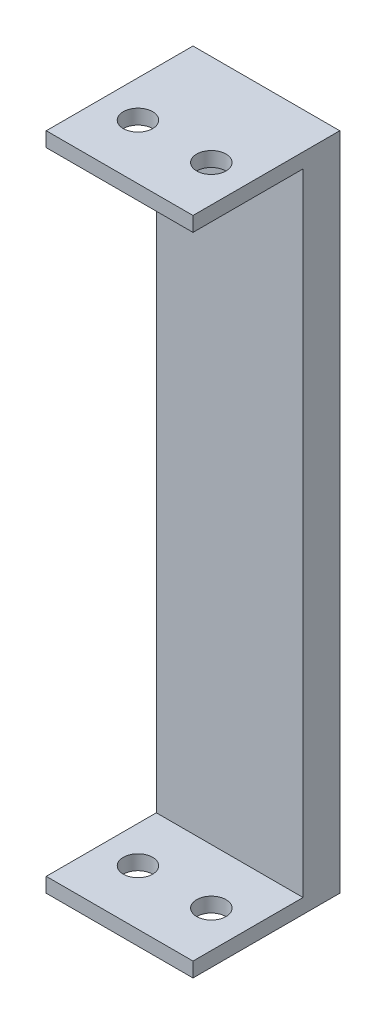
ISO-10303-21;
HEADER;
FILE_DESCRIPTION(('STEP AP214'),'2;1');
FILE_NAME('part.step','',(''),(''),'','','');
FILE_SCHEMA(('AUTOMOTIVE_DESIGN { 1 0 10303 214 1 1 1 1 }'));
ENDSEC;
DATA;
#1=APPLICATION_CONTEXT('core data for automotive mechanical design processes');
#2=APPLICATION_PROTOCOL_DEFINITION('international standard','automotive_design',2000,#1);
#3=PRODUCT_CONTEXT('',#1,'mechanical');
#4=PRODUCT('Part','Part','',(#3));
#5=PRODUCT_RELATED_PRODUCT_CATEGORY('part','',(#4));
#6=PRODUCT_DEFINITION_FORMATION('','',#4);
#7=PRODUCT_DEFINITION_CONTEXT('part definition',#1,'design');
#8=PRODUCT_DEFINITION('design','',#6,#7);
#9=PRODUCT_DEFINITION_SHAPE('','',#8);
#10=(LENGTH_UNIT() NAMED_UNIT(*) SI_UNIT(.MILLI.,.METRE.));
#11=(NAMED_UNIT(*) PLANE_ANGLE_UNIT() SI_UNIT($,.RADIAN.));
#12=(NAMED_UNIT(*) SI_UNIT($,.STERADIAN.) SOLID_ANGLE_UNIT());
#13=UNCERTAINTY_MEASURE_WITH_UNIT(LENGTH_MEASURE(1.E-05),#10,'distance_accuracy_value','');
#14=(GEOMETRIC_REPRESENTATION_CONTEXT(3) GLOBAL_UNCERTAINTY_ASSIGNED_CONTEXT((#13)) GLOBAL_UNIT_ASSIGNED_CONTEXT((#10,
#11,#12)) REPRESENTATION_CONTEXT('',''));
#15=CARTESIAN_POINT('',(0.,0.,0.));
#16=DIRECTION('',(0.,0.,1.));
#17=DIRECTION('',(1.,0.,0.));
#18=AXIS2_PLACEMENT_3D('',#15,#16,#17);
#19=CARTESIAN_POINT('',(0.,0.,20.));
#20=DIRECTION('',(0.,0.,-1.));
#21=DIRECTION('',(-1.,0.,0.));
#22=AXIS2_PLACEMENT_3D('',#19,#20,#21);
#23=PLANE('',#22);
#24=DIRECTION('',(0.,-1.,0.));
#25=VECTOR('',#24,1.);
#26=CARTESIAN_POINT('',(-10.,-45.,20.));
#27=LINE('',#26,#25);
#28=CARTESIAN_POINT('',(-10.,45.,20.));
#29=VERTEX_POINT('',#28);
#30=CARTESIAN_POINT('',(-10.,43.,20.));
#31=VERTEX_POINT('',#30);
#32=EDGE_CURVE('E134',#29,#31,#27,.T.);
#33=ORIENTED_EDGE('',*,*,#32,.T.);
#34=DIRECTION('',(1.,0.,0.));
#35=VECTOR('',#34,1.);
#36=CARTESIAN_POINT('',(-10.001,43.,20.));
#37=LINE('',#36,#35);
#38=CARTESIAN_POINT('',(10.,43.,20.));
#39=VERTEX_POINT('',#38);
#40=EDGE_CURVE('E183',#31,#39,#37,.T.);
#41=ORIENTED_EDGE('',*,*,#40,.T.);
#42=DIRECTION('',(0.,1.,0.));
#43=VECTOR('',#42,1.);
#44=CARTESIAN_POINT('',(10.,-45.,20.));
#45=LINE('',#44,#43);
#46=CARTESIAN_POINT('',(10.,45.,20.));
#47=VERTEX_POINT('',#46);
#48=EDGE_CURVE('E89',#39,#47,#45,.T.);
#49=ORIENTED_EDGE('',*,*,#48,.T.);
#50=DIRECTION('',(-1.,0.,0.));
#51=VECTOR('',#50,1.);
#52=CARTESIAN_POINT('',(-10.,45.,20.));
#53=LINE('',#52,#51);
#54=EDGE_CURVE('E128',#47,#29,#53,.T.);
#55=ORIENTED_EDGE('',*,*,#54,.T.);
#56=EDGE_LOOP('',(#33,#41,#49,#55));
#57=FACE_BOUND('',#56,.T.);
#58=ADVANCED_FACE('F34',(#57),#23,.F.);
#59=CARTESIAN_POINT('',(10.,-45.,20.));
#60=DIRECTION('',(-1.,0.,0.));
#61=DIRECTION('',(0.,0.,1.));
#62=AXIS2_PLACEMENT_3D('',#59,#60,#61);
#63=PLANE('',#62);
#64=ORIENTED_EDGE('',*,*,#48,.F.);
#65=DIRECTION('',(0.,0.,1.));
#66=VECTOR('',#65,1.);
#67=CARTESIAN_POINT('',(10.,43.,20.));
#68=LINE('',#67,#66);
#69=CARTESIAN_POINT('',(10.,43.,5.));
#70=VERTEX_POINT('',#69);
#71=EDGE_CURVE('E117',#70,#39,#68,.T.);
#72=ORIENTED_EDGE('',*,*,#71,.F.);
#73=DIRECTION('',(0.,1.,0.));
#74=VECTOR('',#73,1.);
#75=CARTESIAN_POINT('',(10.,43.,5.));
#76=LINE('',#75,#74);
#77=CARTESIAN_POINT('',(10.,-43.,4.99999999999999));
#78=VERTEX_POINT('',#77);
#79=EDGE_CURVE('E124',#78,#70,#76,.T.);
#80=ORIENTED_EDGE('',*,*,#79,.F.);
#81=DIRECTION('',(0.,0.,-1.));
#82=VECTOR('',#81,1.);
#83=CARTESIAN_POINT('',(10.,-43.,4.99999999999999));
#84=LINE('',#83,#82);
#85=CARTESIAN_POINT('',(10.,-43.,20.));
#86=VERTEX_POINT('',#85);
#87=EDGE_CURVE('E113',#86,#78,#84,.T.);
#88=ORIENTED_EDGE('',*,*,#87,.F.);
#89=CARTESIAN_POINT('',(10.,-45.,20.));
#90=VERTEX_POINT('',#89);
#91=EDGE_CURVE('E121',#90,#86,#45,.T.);
#92=ORIENTED_EDGE('',*,*,#91,.F.);
#93=DIRECTION('',(0.,0.,-1.));
#94=VECTOR('',#93,1.);
#95=CARTESIAN_POINT('',(10.,-45.,20.));
#96=LINE('',#95,#94);
#97=CARTESIAN_POINT('',(10.,-45.,0.));
#98=VERTEX_POINT('',#97);
#99=EDGE_CURVE('E138',#90,#98,#96,.T.);
#100=ORIENTED_EDGE('',*,*,#99,.T.);
#101=DIRECTION('',(0.,1.,0.));
#102=VECTOR('',#101,1.);
#103=CARTESIAN_POINT('',(10.,-45.,0.));
#104=LINE('',#103,#102);
#105=CARTESIAN_POINT('',(10.,45.,0.));
#106=VERTEX_POINT('',#105);
#107=EDGE_CURVE('E139',#98,#106,#104,.T.);
#108=ORIENTED_EDGE('',*,*,#107,.T.);
#109=DIRECTION('',(0.,0.,-1.));
#110=VECTOR('',#109,1.);
#111=CARTESIAN_POINT('',(10.,45.,20.));
#112=LINE('',#111,#110);
#113=EDGE_CURVE('E11',#47,#106,#112,.T.);
#114=ORIENTED_EDGE('',*,*,#113,.F.);
#115=EDGE_LOOP('',(#64,#72,#80,#88,#92,#100,#108,#114));
#116=FACE_BOUND('',#115,.T.);
#117=ADVANCED_FACE('F36',(#116),#63,.F.);
#118=CARTESIAN_POINT('',(-10.,45.,20.));
#119=DIRECTION('',(0.,-1.,0.));
#120=DIRECTION('',(0.,0.,-1.));
#121=AXIS2_PLACEMENT_3D('',#118,#119,#120);
#122=PLANE('',#121);
#123=CARTESIAN_POINT('',(-5.,45.,12.5));
#124=DIRECTION('',(0.,-1.,0.));
#125=DIRECTION('',(0.,0.,-1.));
#126=AXIS2_PLACEMENT_3D('',#123,#124,#125);
#127=CIRCLE('',#126,2.);
#128=CARTESIAN_POINT('',(-5.,45.,10.5));
#129=VERTEX_POINT('',#128);
#130=EDGE_CURVE('E173',#129,#129,#127,.F.);
#131=ORIENTED_EDGE('',*,*,#130,.F.);
#132=EDGE_LOOP('',(#131));
#133=FACE_BOUND('',#132,.T.);
#134=CARTESIAN_POINT('',(5.,45.,12.5));
#135=DIRECTION('',(0.,-1.,0.));
#136=DIRECTION('',(0.,0.,-1.));
#137=AXIS2_PLACEMENT_3D('',#134,#135,#136);
#138=CIRCLE('',#137,2.);
#139=CARTESIAN_POINT('',(5.,45.,10.5));
#140=VERTEX_POINT('',#139);
#141=EDGE_CURVE('E162',#140,#140,#138,.F.);
#142=ORIENTED_EDGE('',*,*,#141,.F.);
#143=EDGE_LOOP('',(#142));
#144=FACE_BOUND('',#143,.T.);
#145=DIRECTION('',(-1.,0.,0.));
#146=VECTOR('',#145,1.);
#147=CARTESIAN_POINT('',(-10.,45.,0.));
#148=LINE('',#147,#146);
#149=CARTESIAN_POINT('',(-10.,45.,0.));
#150=VERTEX_POINT('',#149);
#151=EDGE_CURVE('E142',#106,#150,#148,.T.);
#152=ORIENTED_EDGE('',*,*,#151,.T.);
#153=DIRECTION('',(0.,0.,-1.));
#154=VECTOR('',#153,1.);
#155=CARTESIAN_POINT('',(-10.,45.,20.));
#156=LINE('',#155,#154);
#157=EDGE_CURVE('E43',#29,#150,#156,.T.);
#158=ORIENTED_EDGE('',*,*,#157,.F.);
#159=ORIENTED_EDGE('',*,*,#54,.F.);
#160=ORIENTED_EDGE('',*,*,#113,.T.);
#161=EDGE_LOOP('',(#152,#158,#159,#160));
#162=FACE_BOUND('',#161,.T.);
#163=ADVANCED_FACE('F202',(#133,#144,#162),#122,.F.);
#164=CARTESIAN_POINT('',(-10.,-45.,20.));
#165=DIRECTION('',(1.,0.,0.));
#166=DIRECTION('',(0.,0.,-1.));
#167=AXIS2_PLACEMENT_3D('',#164,#165,#166);
#168=PLANE('',#167);
#169=DIRECTION('',(0.,-1.,0.));
#170=VECTOR('',#169,1.);
#171=CARTESIAN_POINT('',(-10.,43.,5.));
#172=LINE('',#171,#170);
#173=CARTESIAN_POINT('',(-10.,43.,5.));
#174=VERTEX_POINT('',#173);
#175=CARTESIAN_POINT('',(-10.,-43.,4.99999999999999));
#176=VERTEX_POINT('',#175);
#177=EDGE_CURVE('E176',#174,#176,#172,.T.);
#178=ORIENTED_EDGE('',*,*,#177,.F.);
#179=DIRECTION('',(0.,0.,-1.));
#180=VECTOR('',#179,1.);
#181=CARTESIAN_POINT('',(-10.,43.,20.));
#182=LINE('',#181,#180);
#183=EDGE_CURVE('E125',#31,#174,#182,.T.);
#184=ORIENTED_EDGE('',*,*,#183,.F.);
#185=ORIENTED_EDGE('',*,*,#32,.F.);
#186=ORIENTED_EDGE('',*,*,#157,.T.);
#187=DIRECTION('',(0.,-1.,0.));
#188=VECTOR('',#187,1.);
#189=CARTESIAN_POINT('',(-10.,-45.,0.));
#190=LINE('',#189,#188);
#191=CARTESIAN_POINT('',(-10.,-45.,0.));
#192=VERTEX_POINT('',#191);
#193=EDGE_CURVE('E144',#150,#192,#190,.T.);
#194=ORIENTED_EDGE('',*,*,#193,.T.);
#195=DIRECTION('',(0.,0.,-1.));
#196=VECTOR('',#195,1.);
#197=CARTESIAN_POINT('',(-10.,-45.,20.));
#198=LINE('',#197,#196);
#199=CARTESIAN_POINT('',(-10.,-45.,20.));
#200=VERTEX_POINT('',#199);
#201=EDGE_CURVE('E148',#200,#192,#198,.T.);
#202=ORIENTED_EDGE('',*,*,#201,.F.);
#203=CARTESIAN_POINT('',(-10.,-43.,20.));
#204=VERTEX_POINT('',#203);
#205=EDGE_CURVE('E130',#204,#200,#27,.T.);
#206=ORIENTED_EDGE('',*,*,#205,.F.);
#207=DIRECTION('',(0.,0.,1.));
#208=VECTOR('',#207,1.);
#209=CARTESIAN_POINT('',(-10.,-43.,4.99999999999999));
#210=LINE('',#209,#208);
#211=EDGE_CURVE('E51',#176,#204,#210,.T.);
#212=ORIENTED_EDGE('',*,*,#211,.F.);
#213=EDGE_LOOP('',(#178,#184,#185,#186,#194,#202,#206,#212));
#214=FACE_BOUND('',#213,.T.);
#215=ADVANCED_FACE('F192',(#214),#168,.F.);
#216=CARTESIAN_POINT('',(-10.,-45.,20.));
#217=DIRECTION('',(0.,1.,0.));
#218=DIRECTION('',(0.,0.,1.));
#219=AXIS2_PLACEMENT_3D('',#216,#217,#218);
#220=PLANE('',#219);
#221=CARTESIAN_POINT('',(-5.,-45.,12.5));
#222=DIRECTION('',(0.,1.,0.));
#223=DIRECTION('',(0.,0.,1.));
#224=AXIS2_PLACEMENT_3D('',#221,#222,#223);
#225=CIRCLE('',#224,2.);
#226=CARTESIAN_POINT('',(-5.,-45.,14.5));
#227=VERTEX_POINT('',#226);
#228=EDGE_CURVE('E170',#227,#227,#225,.F.);
#229=ORIENTED_EDGE('',*,*,#228,.F.);
#230=EDGE_LOOP('',(#229));
#231=FACE_BOUND('',#230,.T.);
#232=CARTESIAN_POINT('',(5.,-45.,12.5));
#233=DIRECTION('',(0.,1.,0.));
#234=DIRECTION('',(0.,0.,1.));
#235=AXIS2_PLACEMENT_3D('',#232,#233,#234);
#236=CIRCLE('',#235,2.);
#237=CARTESIAN_POINT('',(5.,-45.,14.5));
#238=VERTEX_POINT('',#237);
#239=EDGE_CURVE('E157',#238,#238,#236,.F.);
#240=ORIENTED_EDGE('',*,*,#239,.F.);
#241=EDGE_LOOP('',(#240));
#242=FACE_BOUND('',#241,.T.);
#243=DIRECTION('',(1.,0.,0.));
#244=VECTOR('',#243,1.);
#245=CARTESIAN_POINT('',(-10.,-45.,0.));
#246=LINE('',#245,#244);
#247=EDGE_CURVE('E81',#192,#98,#246,.T.);
#248=ORIENTED_EDGE('',*,*,#247,.T.);
#249=ORIENTED_EDGE('',*,*,#99,.F.);
#250=DIRECTION('',(1.,0.,0.));
#251=VECTOR('',#250,1.);
#252=CARTESIAN_POINT('',(-10.,-45.,20.));
#253=LINE('',#252,#251);
#254=EDGE_CURVE('E60',#200,#90,#253,.T.);
#255=ORIENTED_EDGE('',*,*,#254,.F.);
#256=ORIENTED_EDGE('',*,*,#201,.T.);
#257=EDGE_LOOP('',(#248,#249,#255,#256));
#258=FACE_BOUND('',#257,.T.);
#259=ADVANCED_FACE('F195',(#231,#242,#258),#220,.F.);
#260=ORIENTED_EDGE('',*,*,#91,.T.);
#261=DIRECTION('',(1.,0.,0.));
#262=VECTOR('',#261,1.);
#263=CARTESIAN_POINT('',(-10.001,-43.,20.));
#264=LINE('',#263,#262);
#265=EDGE_CURVE('E110',#204,#86,#264,.T.);
#266=ORIENTED_EDGE('',*,*,#265,.F.);
#267=ORIENTED_EDGE('',*,*,#205,.T.);
#268=ORIENTED_EDGE('',*,*,#254,.T.);
#269=EDGE_LOOP('',(#260,#266,#267,#268));
#270=FACE_BOUND('',#269,.T.);
#271=ADVANCED_FACE('F127',(#270),#23,.F.);
#272=CARTESIAN_POINT('',(0.,0.,0.));
#273=DIRECTION('',(0.,0.,-1.));
#274=DIRECTION('',(-1.,0.,0.));
#275=AXIS2_PLACEMENT_3D('',#272,#273,#274);
#276=PLANE('',#275);
#277=ORIENTED_EDGE('',*,*,#107,.F.);
#278=ORIENTED_EDGE('',*,*,#247,.F.);
#279=ORIENTED_EDGE('',*,*,#193,.F.);
#280=ORIENTED_EDGE('',*,*,#151,.F.);
#281=EDGE_LOOP('',(#277,#278,#279,#280));
#282=FACE_BOUND('',#281,.T.);
#283=ADVANCED_FACE('F199',(#282),#276,.T.);
#284=CARTESIAN_POINT('',(-10.001,43.,20.));
#285=DIRECTION('',(0.,1.,0.));
#286=DIRECTION('',(0.,0.,1.));
#287=AXIS2_PLACEMENT_3D('',#284,#285,#286);
#288=PLANE('',#287);
#289=CARTESIAN_POINT('',(-5.,43.,12.5));
#290=DIRECTION('',(0.,1.,0.));
#291=DIRECTION('',(0.,0.,1.));
#292=AXIS2_PLACEMENT_3D('',#289,#290,#291);
#293=CIRCLE('',#292,2.);
#294=CARTESIAN_POINT('',(-5.,43.,14.5));
#295=VERTEX_POINT('',#294);
#296=EDGE_CURVE('E167',#295,#295,#293,.F.);
#297=ORIENTED_EDGE('',*,*,#296,.F.);
#298=EDGE_LOOP('',(#297));
#299=FACE_BOUND('',#298,.T.);
#300=CARTESIAN_POINT('',(5.,43.,12.5));
#301=DIRECTION('',(0.,1.,0.));
#302=DIRECTION('',(0.,0.,1.));
#303=AXIS2_PLACEMENT_3D('',#300,#301,#302);
#304=CIRCLE('',#303,2.);
#305=CARTESIAN_POINT('',(5.,43.,14.5));
#306=VERTEX_POINT('',#305);
#307=EDGE_CURVE('E153',#306,#306,#304,.F.);
#308=ORIENTED_EDGE('',*,*,#307,.F.);
#309=EDGE_LOOP('',(#308));
#310=FACE_BOUND('',#309,.T.);
#311=ORIENTED_EDGE('',*,*,#183,.T.);
#312=DIRECTION('',(1.,0.,0.));
#313=VECTOR('',#312,1.);
#314=CARTESIAN_POINT('',(-10.001,43.,5.));
#315=LINE('',#314,#313);
#316=EDGE_CURVE('E185',#174,#70,#315,.T.);
#317=ORIENTED_EDGE('',*,*,#316,.T.);
#318=ORIENTED_EDGE('',*,*,#71,.T.);
#319=ORIENTED_EDGE('',*,*,#40,.F.);
#320=EDGE_LOOP('',(#311,#317,#318,#319));
#321=FACE_BOUND('',#320,.T.);
#322=ADVANCED_FACE('F204',(#299,#310,#321),#288,.F.);
#323=CARTESIAN_POINT('',(-10.001,43.,5.));
#324=DIRECTION('',(0.,0.,-1.));
#325=DIRECTION('',(0.,1.,0.));
#326=AXIS2_PLACEMENT_3D('',#323,#324,#325);
#327=PLANE('',#326);
#328=ORIENTED_EDGE('',*,*,#177,.T.);
#329=DIRECTION('',(1.,0.,0.));
#330=VECTOR('',#329,1.);
#331=CARTESIAN_POINT('',(-10.001,-43.,4.99999999999999));
#332=LINE('',#331,#330);
#333=EDGE_CURVE('E116',#176,#78,#332,.T.);
#334=ORIENTED_EDGE('',*,*,#333,.T.);
#335=ORIENTED_EDGE('',*,*,#79,.T.);
#336=ORIENTED_EDGE('',*,*,#316,.F.);
#337=EDGE_LOOP('',(#328,#334,#335,#336));
#338=FACE_BOUND('',#337,.T.);
#339=ADVANCED_FACE('F188',(#338),#327,.F.);
#340=CARTESIAN_POINT('',(-10.001,-43.,4.99999999999999));
#341=DIRECTION('',(0.,-1.,0.));
#342=DIRECTION('',(0.,0.,-1.));
#343=AXIS2_PLACEMENT_3D('',#340,#341,#342);
#344=PLANE('',#343);
#345=CARTESIAN_POINT('',(-5.,-43.,12.5));
#346=DIRECTION('',(0.,-1.,0.));
#347=DIRECTION('',(0.,0.,-1.));
#348=AXIS2_PLACEMENT_3D('',#345,#346,#347);
#349=CIRCLE('',#348,2.);
#350=CARTESIAN_POINT('',(-5.,-43.,10.5));
#351=VERTEX_POINT('',#350);
#352=EDGE_CURVE('E38',#351,#351,#349,.F.);
#353=ORIENTED_EDGE('',*,*,#352,.F.);
#354=EDGE_LOOP('',(#353));
#355=FACE_BOUND('',#354,.T.);
#356=CARTESIAN_POINT('',(5.,-43.,12.5));
#357=DIRECTION('',(0.,-1.,0.));
#358=DIRECTION('',(0.,0.,-1.));
#359=AXIS2_PLACEMENT_3D('',#356,#357,#358);
#360=CIRCLE('',#359,2.);
#361=CARTESIAN_POINT('',(5.,-43.,10.5));
#362=VERTEX_POINT('',#361);
#363=EDGE_CURVE('E151',#362,#362,#360,.F.);
#364=ORIENTED_EDGE('',*,*,#363,.F.);
#365=EDGE_LOOP('',(#364));
#366=FACE_BOUND('',#365,.T.);
#367=ORIENTED_EDGE('',*,*,#211,.T.);
#368=ORIENTED_EDGE('',*,*,#265,.T.);
#369=ORIENTED_EDGE('',*,*,#87,.T.);
#370=ORIENTED_EDGE('',*,*,#333,.F.);
#371=EDGE_LOOP('',(#367,#368,#369,#370));
#372=FACE_BOUND('',#371,.T.);
#373=ADVANCED_FACE('F112',(#355,#366,#372),#344,.F.);
#374=CARTESIAN_POINT('',(5.,45.000012,12.5));
#375=DIRECTION('',(0.,-1.,0.));
#376=DIRECTION('',(0.,0.,-1.));
#377=AXIS2_PLACEMENT_3D('',#374,#375,#376);
#378=CYLINDRICAL_SURFACE('',#377,2.);
#379=ORIENTED_EDGE('',*,*,#363,.T.);
#380=EDGE_LOOP('',(#379));
#381=FACE_BOUND('',#380,.T.);
#382=ORIENTED_EDGE('',*,*,#239,.T.);
#383=EDGE_LOOP('',(#382));
#384=FACE_BOUND('',#383,.T.);
#385=ADVANCED_FACE('F239',(#381,#384),#378,.F.);
#386=CARTESIAN_POINT('',(-5.,45.000012,12.5));
#387=DIRECTION('',(0.,-1.,0.));
#388=DIRECTION('',(0.,0.,-1.));
#389=AXIS2_PLACEMENT_3D('',#386,#387,#388);
#390=CYLINDRICAL_SURFACE('',#389,2.);
#391=ORIENTED_EDGE('',*,*,#352,.T.);
#392=EDGE_LOOP('',(#391));
#393=FACE_BOUND('',#392,.T.);
#394=ORIENTED_EDGE('',*,*,#228,.T.);
#395=EDGE_LOOP('',(#394));
#396=FACE_BOUND('',#395,.T.);
#397=ADVANCED_FACE('F237',(#393,#396),#390,.F.);
#398=ORIENTED_EDGE('',*,*,#307,.T.);
#399=EDGE_LOOP('',(#398));
#400=FACE_BOUND('',#399,.T.);
#401=ORIENTED_EDGE('',*,*,#141,.T.);
#402=EDGE_LOOP('',(#401));
#403=FACE_BOUND('',#402,.T.);
#404=ADVANCED_FACE('F234',(#400,#403),#378,.F.);
#405=ORIENTED_EDGE('',*,*,#296,.T.);
#406=EDGE_LOOP('',(#405));
#407=FACE_BOUND('',#406,.T.);
#408=ORIENTED_EDGE('',*,*,#130,.T.);
#409=EDGE_LOOP('',(#408));
#410=FACE_BOUND('',#409,.T.);
#411=ADVANCED_FACE('F236',(#407,#410),#390,.F.);
#412=CLOSED_SHELL('',(#58,#117,#163,#215,#259,#271,#283,#322,#339,#373,#385,#397,#404,#411));
#413=MANIFOLD_SOLID_BREP('B2',#412);
#414=ADVANCED_BREP_SHAPE_REPRESENTATION('',(#18,#413),#14);
#415=SHAPE_DEFINITION_REPRESENTATION(#9,#414);
ENDSEC;
END-ISO-10303-21;
